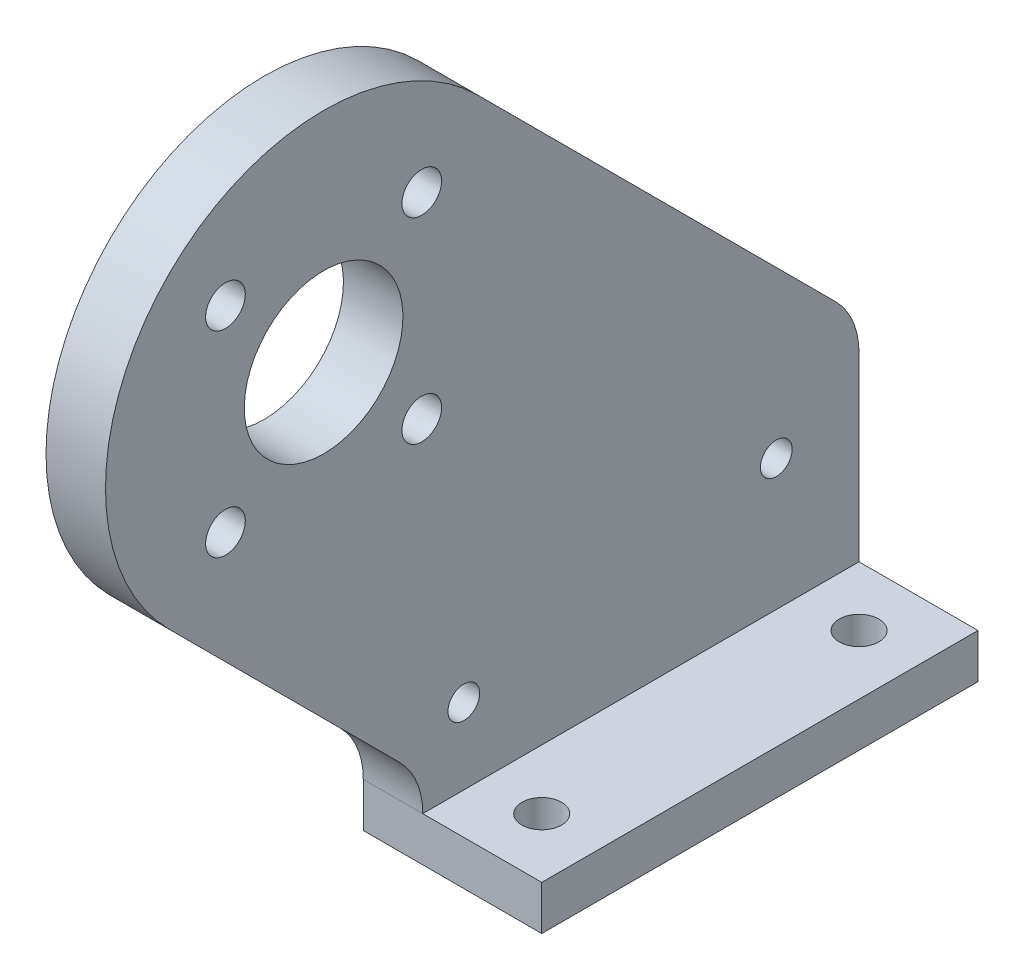
ISO-10303-21;
HEADER;
FILE_DESCRIPTION(('STEP AP214'),'2;1');
FILE_NAME('part.step','',(''),(''),'','','');
FILE_SCHEMA(('AUTOMOTIVE_DESIGN { 1 0 10303 214 1 1 1 1 }'));
ENDSEC;
DATA;
#1=APPLICATION_CONTEXT('core data for automotive mechanical design processes');
#2=APPLICATION_PROTOCOL_DEFINITION('international standard','automotive_design',2000,#1);
#3=PRODUCT_CONTEXT('',#1,'mechanical');
#4=PRODUCT('Part','Part','',(#3));
#5=PRODUCT_RELATED_PRODUCT_CATEGORY('part','',(#4));
#6=PRODUCT_DEFINITION_FORMATION('','',#4);
#7=PRODUCT_DEFINITION_CONTEXT('part definition',#1,'design');
#8=PRODUCT_DEFINITION('design','',#6,#7);
#9=PRODUCT_DEFINITION_SHAPE('','',#8);
#10=(LENGTH_UNIT() NAMED_UNIT(*) SI_UNIT(.MILLI.,.METRE.));
#11=(NAMED_UNIT(*) PLANE_ANGLE_UNIT() SI_UNIT($,.RADIAN.));
#12=(NAMED_UNIT(*) SI_UNIT($,.STERADIAN.) SOLID_ANGLE_UNIT());
#13=UNCERTAINTY_MEASURE_WITH_UNIT(LENGTH_MEASURE(1.E-05),#10,'distance_accuracy_value','');
#14=(GEOMETRIC_REPRESENTATION_CONTEXT(3) GLOBAL_UNCERTAINTY_ASSIGNED_CONTEXT((#13)) GLOBAL_UNIT_ASSIGNED_CONTEXT((#10,
#11,#12)) REPRESENTATION_CONTEXT('',''));
#15=CARTESIAN_POINT('',(0.,0.,0.));
#16=DIRECTION('',(0.,0.,1.));
#17=DIRECTION('',(1.,0.,0.));
#18=AXIS2_PLACEMENT_3D('',#15,#16,#17);
#19=CARTESIAN_POINT('',(58.5,-18.900505063,-2.));
#20=DIRECTION('',(1.,0.,0.));
#21=DIRECTION('',(0.,1.,0.));
#22=AXIS2_PLACEMENT_3D('',#19,#20,#21);
#23=CYLINDRICAL_SURFACE('',#22,4.);
#24=CARTESIAN_POINT('',(58.5,-18.900505063,-2.));
#25=DIRECTION('',(1.,0.,0.));
#26=DIRECTION('',(0.,1.,0.));
#27=AXIS2_PLACEMENT_3D('',#24,#25,#26);
#28=CIRCLE('',#27,4.);
#29=CARTESIAN_POINT('',(58.5,-18.900505063,-6.));
#30=VERTEX_POINT('',#29);
#31=CARTESIAN_POINT('',(58.5,-16.07207793875,-4.82842712475));
#32=VERTEX_POINT('',#31);
#33=EDGE_CURVE('E21',#30,#32,#28,.T.);
#34=ORIENTED_EDGE('',*,*,#33,.T.);
#35=DIRECTION('',(1.,0.,0.));
#36=VECTOR('',#35,1.);
#37=CARTESIAN_POINT('',(60.,-16.072077939,-4.828427125));
#38=LINE('',#37,#36);
#39=CARTESIAN_POINT('',(61.5,-16.0720779371654,-4.82842712599426));
#40=VERTEX_POINT('',#39);
#41=EDGE_CURVE('E110',#32,#40,#38,.T.);
#42=ORIENTED_EDGE('',*,*,#41,.T.);
#43=CARTESIAN_POINT('',(61.5,-18.900505063,-2.));
#44=DIRECTION('',(1.,0.,0.));
#45=DIRECTION('',(0.,1.,0.));
#46=AXIS2_PLACEMENT_3D('',#43,#44,#45);
#47=CIRCLE('',#46,4.);
#48=CARTESIAN_POINT('',(61.5,-18.900505063,-6.));
#49=VERTEX_POINT('',#48);
#50=EDGE_CURVE('E102',#49,#40,#47,.T.);
#51=ORIENTED_EDGE('',*,*,#50,.F.);
#52=DIRECTION('',(1.,0.,0.));
#53=VECTOR('',#52,1.);
#54=CARTESIAN_POINT('',(63.,-18.900505063,-6.));
#55=LINE('',#54,#53);
#56=EDGE_CURVE('E94',#30,#49,#55,.T.);
#57=ORIENTED_EDGE('',*,*,#56,.F.);
#58=EDGE_LOOP('',(#34,#42,#51,#57));
#59=FACE_BOUND('',#58,.T.);
#60=ADVANCED_FACE('F17',(#59),#23,.T.);
#61=CARTESIAN_POINT('',(61.5,-16.072077939,-4.828427125));
#62=DIRECTION('',(0.,-0.707106781186547,0.707106781186547));
#63=DIRECTION('',(0.,0.707106781186547,0.707106781186547));
#64=AXIS2_PLACEMENT_3D('',#61,#62,#63);
#65=PLANE('',#64);
#66=DIRECTION('',(0.,0.707106781186547,0.707106781186547));
#67=VECTOR('',#66,1.);
#68=CARTESIAN_POINT('',(58.5,-16.072077939,-4.828427125));
#69=LINE('',#68,#67);
#70=CARTESIAN_POINT('',(58.5,1.97817459217873,13.2218254061267));
#71=VERTEX_POINT('',#70);
#72=EDGE_CURVE('E85',#32,#71,#69,.T.);
#73=ORIENTED_EDGE('',*,*,#72,.T.);
#74=DIRECTION('',(-1.,0.,0.));
#75=VECTOR('',#74,1.);
#76=CARTESIAN_POINT('',(60.,1.97817459135746,13.2218254052534));
#77=LINE('',#76,#75);
#78=CARTESIAN_POINT('',(61.5,1.97817459297517,13.2218254062661));
#79=VERTEX_POINT('',#78);
#80=EDGE_CURVE('E211',#71,#79,#77,.F.);
#81=ORIENTED_EDGE('',*,*,#80,.T.);
#82=DIRECTION('',(0.,0.707106781101469,0.707106781271627));
#83=VECTOR('',#82,1.);
#84=CARTESIAN_POINT('',(61.5,-16.0720779422184,-4.828427133876));
#85=LINE('',#84,#83);
#86=EDGE_CURVE('E174',#40,#79,#85,.T.);
#87=ORIENTED_EDGE('',*,*,#86,.F.);
#88=ORIENTED_EDGE('',*,*,#41,.F.);
#89=EDGE_LOOP('',(#73,#81,#87,#88));
#90=FACE_BOUND('',#89,.T.);
#91=ADVANCED_FACE('F209',(#90),#65,.F.);
#92=CARTESIAN_POINT('',(61.5,-5.8,21.));
#93=DIRECTION('',(-1.,0.,0.));
#94=DIRECTION('',(0.,-1.,0.));
#95=AXIS2_PLACEMENT_3D('',#92,#93,#94);
#96=CYLINDRICAL_SURFACE('',#95,11.);
#97=ORIENTED_EDGE('',*,*,#80,.F.);
#98=CARTESIAN_POINT('',(58.5,-5.8,21.));
#99=DIRECTION('',(-1.,0.,0.));
#100=DIRECTION('',(0.,-1.,0.));
#101=AXIS2_PLACEMENT_3D('',#98,#99,#100);
#102=CIRCLE('',#101,11.);
#103=CARTESIAN_POINT('',(58.5,-13.578174593,28.778174593));
#104=VERTEX_POINT('',#103);
#105=EDGE_CURVE('E204',#71,#104,#102,.F.);
#106=ORIENTED_EDGE('',*,*,#105,.T.);
#107=DIRECTION('',(1.,0.,0.));
#108=VECTOR('',#107,1.);
#109=CARTESIAN_POINT('',(60.,-13.578174593,28.778174593));
#110=LINE('',#109,#108);
#111=CARTESIAN_POINT('',(61.5,-13.5781745846093,28.778174587786));
#112=VERTEX_POINT('',#111);
#113=EDGE_CURVE('E213',#104,#112,#110,.T.);
#114=ORIENTED_EDGE('',*,*,#113,.T.);
#115=CARTESIAN_POINT('',(61.5,-5.8,21.));
#116=DIRECTION('',(-1.,0.,0.));
#117=DIRECTION('',(0.,-1.,0.));
#118=AXIS2_PLACEMENT_3D('',#115,#116,#117);
#119=CIRCLE('',#118,11.);
#120=EDGE_CURVE('E172',#79,#112,#119,.F.);
#121=ORIENTED_EDGE('',*,*,#120,.F.);
#122=EDGE_LOOP('',(#97,#106,#114,#121));
#123=FACE_BOUND('',#122,.T.);
#124=ADVANCED_FACE('F267',(#123),#96,.T.);
#125=CARTESIAN_POINT('',(61.5,-13.578174593,28.778174593));
#126=DIRECTION('',(0.,0.707106781186548,-0.707106781186547));
#127=DIRECTION('',(0.,-0.707106781186547,-0.707106781186548));
#128=AXIS2_PLACEMENT_3D('',#125,#126,#127);
#129=PLANE('',#128);
#130=DIRECTION('',(0.,-0.707106781186547,-0.707106781186548));
#131=VECTOR('',#130,1.);
#132=CARTESIAN_POINT('',(58.5,-13.578174593,28.778174593));
#133=LINE('',#132,#131);
#134=CARTESIAN_POINT('',(58.5,-25.1847763120801,17.1715728744199));
#135=VERTEX_POINT('',#134);
#136=EDGE_CURVE('E201',#104,#135,#133,.T.);
#137=ORIENTED_EDGE('',*,*,#136,.T.);
#138=DIRECTION('',(1.,0.,0.));
#139=VECTOR('',#138,1.);
#140=CARTESIAN_POINT('',(60.,-25.1847763131602,17.1715728738398));
#141=LINE('',#140,#139);
#142=CARTESIAN_POINT('',(61.5,-25.1847763082255,17.1715728694101));
#143=VERTEX_POINT('',#142);
#144=EDGE_CURVE('E89',#143,#135,#141,.F.);
#145=ORIENTED_EDGE('',*,*,#144,.F.);
#146=DIRECTION('',(0.,-0.707106781475344,-0.707106780897751));
#147=VECTOR('',#146,1.);
#148=CARTESIAN_POINT('',(61.5,-13.5781745803226,28.778174578468));
#149=LINE('',#148,#147);
#150=EDGE_CURVE('E170',#112,#143,#149,.T.);
#151=ORIENTED_EDGE('',*,*,#150,.F.);
#152=ORIENTED_EDGE('',*,*,#113,.F.);
#153=EDGE_LOOP('',(#137,#145,#151,#152));
#154=FACE_BOUND('',#153,.T.);
#155=ADVANCED_FACE('F264',(#154),#129,.F.);
#156=CARTESIAN_POINT('',(61.5,-28.013203436,20.));
#157=DIRECTION('',(-1.,0.,0.));
#158=DIRECTION('',(0.,-1.,0.));
#159=AXIS2_PLACEMENT_3D('',#156,#157,#158);
#160=CYLINDRICAL_SURFACE('',#159,3.99999999965183);
#161=DIRECTION('',(-1.,0.,0.));
#162=VECTOR('',#161,1.);
#163=CARTESIAN_POINT('',(63.,-28.013203436,16.));
#164=LINE('',#163,#162);
#165=CARTESIAN_POINT('',(61.4999999985,-28.013203436,16.0000000001741));
#166=VERTEX_POINT('',#165);
#167=CARTESIAN_POINT('',(58.5,-28.013203436,16.));
#168=VERTEX_POINT('',#167);
#169=EDGE_CURVE('E106',#166,#168,#164,.T.);
#170=ORIENTED_EDGE('',*,*,#169,.F.);
#171=CARTESIAN_POINT('',(61.5,-28.013203436,20.));
#172=DIRECTION('',(-1.,0.,0.));
#173=DIRECTION('',(0.,-1.,0.));
#174=AXIS2_PLACEMENT_3D('',#171,#172,#173);
#175=CIRCLE('',#174,3.99999999965183);
#176=EDGE_CURVE('E36',#143,#166,#175,.T.);
#177=ORIENTED_EDGE('',*,*,#176,.F.);
#178=ORIENTED_EDGE('',*,*,#144,.T.);
#179=CARTESIAN_POINT('',(58.5,-28.013203436,20.));
#180=DIRECTION('',(-1.,0.,0.));
#181=DIRECTION('',(0.,-1.,0.));
#182=AXIS2_PLACEMENT_3D('',#179,#180,#181);
#183=CIRCLE('',#182,3.99999999965183);
#184=EDGE_CURVE('E198',#135,#168,#183,.T.);
#185=ORIENTED_EDGE('',*,*,#184,.T.);
#186=EDGE_LOOP('',(#170,#177,#178,#185));
#187=FACE_BOUND('',#186,.T.);
#188=ADVANCED_FACE('F275',(#187),#160,.F.);
#189=CARTESIAN_POINT('',(61.5,-10.749747468,25.949747468));
#190=DIRECTION('',(-1.,0.,0.));
#191=DIRECTION('',(0.,-1.,0.));
#192=AXIS2_PLACEMENT_3D('',#189,#190,#191);
#193=CYLINDRICAL_SURFACE('',#192,1.);
#194=CARTESIAN_POINT('',(61.5,-10.749747468,25.949747468));
#195=DIRECTION('',(-1.,0.,0.));
#196=DIRECTION('',(0.,-1.,0.));
#197=AXIS2_PLACEMENT_3D('',#194,#195,#196);
#198=CIRCLE('',#197,1.);
#199=CARTESIAN_POINT('',(61.5,-11.749747468,25.949747468));
#200=VERTEX_POINT('',#199);
#201=EDGE_CURVE('E166',#200,#200,#198,.T.);
#202=ORIENTED_EDGE('',*,*,#201,.F.);
#203=EDGE_LOOP('',(#202));
#204=FACE_BOUND('',#203,.T.);
#205=CARTESIAN_POINT('',(58.5,-10.749747468,25.949747468));
#206=DIRECTION('',(-1.,0.,0.));
#207=DIRECTION('',(0.,-1.,0.));
#208=AXIS2_PLACEMENT_3D('',#205,#206,#207);
#209=CIRCLE('',#208,1.);
#210=CARTESIAN_POINT('',(58.5,-11.749747468,25.949747468));
#211=VERTEX_POINT('',#210);
#212=EDGE_CURVE('E195',#211,#211,#209,.T.);
#213=ORIENTED_EDGE('',*,*,#212,.T.);
#214=EDGE_LOOP('',(#213));
#215=FACE_BOUND('',#214,.T.);
#216=ADVANCED_FACE('F317',(#204,#215),#193,.F.);
#217=CARTESIAN_POINT('',(61.5,-10.749747468,16.050252532));
#218=DIRECTION('',(-1.,0.,0.));
#219=DIRECTION('',(0.,-1.,0.));
#220=AXIS2_PLACEMENT_3D('',#217,#218,#219);
#221=CYLINDRICAL_SURFACE('',#220,1.);
#222=CARTESIAN_POINT('',(61.5,-10.749747468,16.050252532));
#223=DIRECTION('',(-1.,0.,0.));
#224=DIRECTION('',(0.,-1.,0.));
#225=AXIS2_PLACEMENT_3D('',#222,#223,#224);
#226=CIRCLE('',#225,1.);
#227=CARTESIAN_POINT('',(61.5,-11.749747468,16.050252532));
#228=VERTEX_POINT('',#227);
#229=EDGE_CURVE('E163',#228,#228,#226,.T.);
#230=ORIENTED_EDGE('',*,*,#229,.F.);
#231=EDGE_LOOP('',(#230));
#232=FACE_BOUND('',#231,.T.);
#233=CARTESIAN_POINT('',(58.5,-10.749747468,16.050252532));
#234=DIRECTION('',(-1.,0.,0.));
#235=DIRECTION('',(0.,-1.,0.));
#236=AXIS2_PLACEMENT_3D('',#233,#234,#235);
#237=CIRCLE('',#236,1.);
#238=CARTESIAN_POINT('',(58.5,-11.749747468,16.050252532));
#239=VERTEX_POINT('',#238);
#240=EDGE_CURVE('E99',#239,#239,#237,.T.);
#241=ORIENTED_EDGE('',*,*,#240,.T.);
#242=EDGE_LOOP('',(#241));
#243=FACE_BOUND('',#242,.T.);
#244=ADVANCED_FACE('F313',(#232,#243),#221,.F.);
#245=CARTESIAN_POINT('',(61.5,-0.850252532,16.050252532));
#246=DIRECTION('',(-1.,0.,0.));
#247=DIRECTION('',(0.,-1.,0.));
#248=AXIS2_PLACEMENT_3D('',#245,#246,#247);
#249=CYLINDRICAL_SURFACE('',#248,1.);
#250=CARTESIAN_POINT('',(61.5,-0.850252532,16.050252532));
#251=DIRECTION('',(-1.,0.,0.));
#252=DIRECTION('',(0.,-1.,0.));
#253=AXIS2_PLACEMENT_3D('',#250,#251,#252);
#254=CIRCLE('',#253,1.);
#255=CARTESIAN_POINT('',(61.5,-1.850252532,16.050252532));
#256=VERTEX_POINT('',#255);
#257=EDGE_CURVE('E160',#256,#256,#254,.T.);
#258=ORIENTED_EDGE('',*,*,#257,.F.);
#259=EDGE_LOOP('',(#258));
#260=FACE_BOUND('',#259,.T.);
#261=CARTESIAN_POINT('',(58.5,-0.85025253200001,16.050252532));
#262=DIRECTION('',(-1.,0.,0.));
#263=DIRECTION('',(0.,-1.,0.));
#264=AXIS2_PLACEMENT_3D('',#261,#262,#263);
#265=CIRCLE('',#264,1.);
#266=CARTESIAN_POINT('',(58.5,-1.85025253200001,16.050252532));
#267=VERTEX_POINT('',#266);
#268=EDGE_CURVE('E192',#267,#267,#265,.T.);
#269=ORIENTED_EDGE('',*,*,#268,.T.);
#270=EDGE_LOOP('',(#269));
#271=FACE_BOUND('',#270,.T.);
#272=ADVANCED_FACE('F309',(#260,#271),#249,.F.);
#273=CARTESIAN_POINT('',(61.5,-0.850252532,25.949747468));
#274=DIRECTION('',(-1.,0.,0.));
#275=DIRECTION('',(0.,-1.,0.));
#276=AXIS2_PLACEMENT_3D('',#273,#274,#275);
#277=CYLINDRICAL_SURFACE('',#276,1.);
#278=CARTESIAN_POINT('',(61.5,-0.850252532,25.949747468));
#279=DIRECTION('',(-1.,0.,0.));
#280=DIRECTION('',(0.,-1.,0.));
#281=AXIS2_PLACEMENT_3D('',#278,#279,#280);
#282=CIRCLE('',#281,1.);
#283=CARTESIAN_POINT('',(61.5,-1.850252532,25.949747468));
#284=VERTEX_POINT('',#283);
#285=EDGE_CURVE('E157',#284,#284,#282,.T.);
#286=ORIENTED_EDGE('',*,*,#285,.F.);
#287=EDGE_LOOP('',(#286));
#288=FACE_BOUND('',#287,.T.);
#289=CARTESIAN_POINT('',(58.5,-0.85025253200001,25.949747468));
#290=DIRECTION('',(-1.,0.,0.));
#291=DIRECTION('',(0.,-1.,0.));
#292=AXIS2_PLACEMENT_3D('',#289,#290,#291);
#293=CIRCLE('',#292,1.);
#294=CARTESIAN_POINT('',(58.5,-1.85025253200001,25.949747468));
#295=VERTEX_POINT('',#294);
#296=EDGE_CURVE('E180',#295,#295,#293,.T.);
#297=ORIENTED_EDGE('',*,*,#296,.T.);
#298=EDGE_LOOP('',(#297));
#299=FACE_BOUND('',#298,.T.);
#300=ADVANCED_FACE('F305',(#288,#299),#277,.F.);
#301=CARTESIAN_POINT('',(61.5,-24.184776311,13.928932188));
#302=DIRECTION('',(-1.,0.,0.));
#303=DIRECTION('',(0.,0.,1.));
#304=AXIS2_PLACEMENT_3D('',#301,#302,#303);
#305=CYLINDRICAL_SURFACE('',#304,0.799999999999995);
#306=CARTESIAN_POINT('',(58.5,-24.184776311,13.928932188));
#307=DIRECTION('',(-1.,0.,0.));
#308=DIRECTION('',(0.,0.,1.));
#309=AXIS2_PLACEMENT_3D('',#306,#307,#308);
#310=CIRCLE('',#309,0.799999999999995);
#311=CARTESIAN_POINT('',(58.5,-24.184776311,14.728932188));
#312=VERTEX_POINT('',#311);
#313=EDGE_CURVE('E189',#312,#312,#310,.T.);
#314=ORIENTED_EDGE('',*,*,#313,.T.);
#315=EDGE_LOOP('',(#314));
#316=FACE_BOUND('',#315,.T.);
#317=CARTESIAN_POINT('',(61.5,-24.184776311,13.928932188));
#318=DIRECTION('',(-1.,0.,0.));
#319=DIRECTION('',(0.,0.,1.));
#320=AXIS2_PLACEMENT_3D('',#317,#318,#319);
#321=CIRCLE('',#320,0.799999999999995);
#322=CARTESIAN_POINT('',(61.5,-24.184776311,14.728932188));
#323=VERTEX_POINT('',#322);
#324=EDGE_CURVE('E154',#323,#323,#321,.T.);
#325=ORIENTED_EDGE('',*,*,#324,.F.);
#326=EDGE_LOOP('',(#325));
#327=FACE_BOUND('',#326,.T.);
#328=ADVANCED_FACE('F301',(#316,#327),#305,.F.);
#329=CARTESIAN_POINT('',(61.5,-21.406405468,-1.82799186));
#330=DIRECTION('',(-1.,0.,0.));
#331=DIRECTION('',(0.,0.,1.));
#332=AXIS2_PLACEMENT_3D('',#329,#330,#331);
#333=CYLINDRICAL_SURFACE('',#332,0.800000000000002);
#334=CARTESIAN_POINT('',(58.5,-21.406405468,-1.82799186000001));
#335=DIRECTION('',(-1.,0.,0.));
#336=DIRECTION('',(0.,0.,1.));
#337=AXIS2_PLACEMENT_3D('',#334,#335,#336);
#338=CIRCLE('',#337,0.800000000000002);
#339=CARTESIAN_POINT('',(58.5,-21.406405468,-1.02799186000001));
#340=VERTEX_POINT('',#339);
#341=EDGE_CURVE('E183',#340,#340,#338,.T.);
#342=ORIENTED_EDGE('',*,*,#341,.T.);
#343=EDGE_LOOP('',(#342));
#344=FACE_BOUND('',#343,.T.);
#345=CARTESIAN_POINT('',(61.5,-21.406405468,-1.82799186));
#346=DIRECTION('',(-1.,0.,0.));
#347=DIRECTION('',(0.,0.,1.));
#348=AXIS2_PLACEMENT_3D('',#345,#346,#347);
#349=CIRCLE('',#348,0.800000000000002);
#350=CARTESIAN_POINT('',(61.5,-21.406405468,-1.02799186));
#351=VERTEX_POINT('',#350);
#352=EDGE_CURVE('E151',#351,#351,#349,.T.);
#353=ORIENTED_EDGE('',*,*,#352,.F.);
#354=EDGE_LOOP('',(#353));
#355=FACE_BOUND('',#354,.T.);
#356=ADVANCED_FACE('F297',(#344,#355),#333,.F.);
#357=CARTESIAN_POINT('',(61.5,-5.8,21.));
#358=DIRECTION('',(-1.,0.,0.));
#359=DIRECTION('',(0.,-1.,0.));
#360=AXIS2_PLACEMENT_3D('',#357,#358,#359);
#361=CYLINDRICAL_SURFACE('',#360,4.);
#362=CARTESIAN_POINT('',(58.5,-5.8,21.));
#363=DIRECTION('',(-1.,0.,0.));
#364=DIRECTION('',(0.,-1.,0.));
#365=AXIS2_PLACEMENT_3D('',#362,#363,#364);
#366=CIRCLE('',#365,4.);
#367=CARTESIAN_POINT('',(58.5,-9.8,21.));
#368=VERTEX_POINT('',#367);
#369=EDGE_CURVE('E186',#368,#368,#366,.T.);
#370=ORIENTED_EDGE('',*,*,#369,.T.);
#371=EDGE_LOOP('',(#370));
#372=FACE_BOUND('',#371,.T.);
#373=CARTESIAN_POINT('',(61.5,-5.8,21.));
#374=DIRECTION('',(-1.,0.,0.));
#375=DIRECTION('',(0.,-1.,0.));
#376=AXIS2_PLACEMENT_3D('',#373,#374,#375);
#377=CIRCLE('',#376,4.);
#378=CARTESIAN_POINT('',(61.5,-9.8,21.));
#379=VERTEX_POINT('',#378);
#380=EDGE_CURVE('E122',#379,#379,#377,.T.);
#381=ORIENTED_EDGE('',*,*,#380,.F.);
#382=EDGE_LOOP('',(#381));
#383=FACE_BOUND('',#382,.T.);
#384=ADVANCED_FACE('F294',(#372,#383),#361,.F.);
#385=CARTESIAN_POINT('',(58.5,-30.249489743,32.228));
#386=DIRECTION('',(1.,0.,0.));
#387=DIRECTION('',(0.,0.,-1.));
#388=AXIS2_PLACEMENT_3D('',#385,#386,#387);
#389=PLANE('',#388);
#390=ORIENTED_EDGE('',*,*,#240,.F.);
#391=EDGE_LOOP('',(#390));
#392=FACE_BOUND('',#391,.T.);
#393=ORIENTED_EDGE('',*,*,#296,.F.);
#394=EDGE_LOOP('',(#393));
#395=FACE_BOUND('',#394,.T.);
#396=ORIENTED_EDGE('',*,*,#341,.F.);
#397=EDGE_LOOP('',(#396));
#398=FACE_BOUND('',#397,.T.);
#399=ORIENTED_EDGE('',*,*,#369,.F.);
#400=EDGE_LOOP('',(#399));
#401=FACE_BOUND('',#400,.T.);
#402=ORIENTED_EDGE('',*,*,#313,.F.);
#403=EDGE_LOOP('',(#402));
#404=FACE_BOUND('',#403,.T.);
#405=ORIENTED_EDGE('',*,*,#268,.F.);
#406=EDGE_LOOP('',(#405));
#407=FACE_BOUND('',#406,.T.);
#408=ORIENTED_EDGE('',*,*,#212,.F.);
#409=EDGE_LOOP('',(#408));
#410=FACE_BOUND('',#409,.T.);
#411=ORIENTED_EDGE('',*,*,#136,.F.);
#412=ORIENTED_EDGE('',*,*,#105,.F.);
#413=ORIENTED_EDGE('',*,*,#72,.F.);
#414=ORIENTED_EDGE('',*,*,#33,.F.);
#415=DIRECTION('',(0.,1.,0.));
#416=VECTOR('',#415,1.);
#417=CARTESIAN_POINT('',(58.5,-24.574997403,-6.));
#418=LINE('',#417,#416);
#419=CARTESIAN_POINT('',(58.5,-30.249489743,-6.));
#420=VERTEX_POINT('',#419);
#421=EDGE_CURVE('E81',#420,#30,#418,.T.);
#422=ORIENTED_EDGE('',*,*,#421,.F.);
#423=DIRECTION('',(0.,0.,-1.));
#424=VECTOR('',#423,1.);
#425=CARTESIAN_POINT('',(58.5,-30.249489743,5.));
#426=LINE('',#425,#424);
#427=CARTESIAN_POINT('',(58.5,-30.249489743,16.));
#428=VERTEX_POINT('',#427);
#429=EDGE_CURVE('E121',#428,#420,#426,.T.);
#430=ORIENTED_EDGE('',*,*,#429,.F.);
#431=DIRECTION('',(0.,-1.,0.));
#432=VECTOR('',#431,1.);
#433=CARTESIAN_POINT('',(58.5,-29.1313465895,16.));
#434=LINE('',#433,#432);
#435=EDGE_CURVE('E125',#168,#428,#434,.T.);
#436=ORIENTED_EDGE('',*,*,#435,.F.);
#437=ORIENTED_EDGE('',*,*,#184,.F.);
#438=EDGE_LOOP('',(#411,#412,#413,#414,#422,#430,#436,#437));
#439=FACE_BOUND('',#438,.T.);
#440=ADVANCED_FACE('F79',(#392,#395,#398,#401,#404,#407,#410,#439),#389,.F.);
#441=CARTESIAN_POINT('',(58.5,-18.900505063,-6.));
#442=DIRECTION('',(0.,0.,-1.));
#443=DIRECTION('',(1.,0.,0.));
#444=AXIS2_PLACEMENT_3D('',#441,#442,#443);
#445=PLANE('',#444);
#446=DIRECTION('',(1.,0.,0.));
#447=VECTOR('',#446,1.);
#448=CARTESIAN_POINT('',(64.5,-28.013203436,-6.));
#449=LINE('',#448,#447);
#450=CARTESIAN_POINT('',(61.5,-28.013203436,-6.));
#451=VERTEX_POINT('',#450);
#452=CARTESIAN_POINT('',(67.5,-28.013203436,-6.));
#453=VERTEX_POINT('',#452);
#454=EDGE_CURVE('E148',#451,#453,#449,.T.);
#455=ORIENTED_EDGE('',*,*,#454,.T.);
#456=DIRECTION('',(0.,1.,0.));
#457=VECTOR('',#456,1.);
#458=CARTESIAN_POINT('',(67.5,-29.1313465895,-6.));
#459=LINE('',#458,#457);
#460=CARTESIAN_POINT('',(67.5,-30.249489743,-6.));
#461=VERTEX_POINT('',#460);
#462=EDGE_CURVE('E103',#461,#453,#459,.T.);
#463=ORIENTED_EDGE('',*,*,#462,.F.);
#464=DIRECTION('',(1.,0.,0.));
#465=VECTOR('',#464,1.);
#466=CARTESIAN_POINT('',(63.,-30.249489743,-6.));
#467=LINE('',#466,#465);
#468=EDGE_CURVE('E98',#420,#461,#467,.T.);
#469=ORIENTED_EDGE('',*,*,#468,.F.);
#470=ORIENTED_EDGE('',*,*,#421,.T.);
#471=ORIENTED_EDGE('',*,*,#56,.T.);
#472=DIRECTION('',(0.,1.,0.));
#473=VECTOR('',#472,1.);
#474=CARTESIAN_POINT('',(61.5,-11.3069621075,-6.));
#475=LINE('',#474,#473);
#476=EDGE_CURVE('E177',#451,#49,#475,.T.);
#477=ORIENTED_EDGE('',*,*,#476,.F.);
#478=EDGE_LOOP('',(#455,#463,#469,#470,#471,#477));
#479=FACE_BOUND('',#478,.T.);
#480=ADVANCED_FACE('F92',(#479),#445,.T.);
#481=CARTESIAN_POINT('',(67.5,-30.249489743,16.));
#482=DIRECTION('',(1.,0.,0.));
#483=DIRECTION('',(0.,0.,-1.));
#484=AXIS2_PLACEMENT_3D('',#481,#482,#483);
#485=PLANE('',#484);
#486=ORIENTED_EDGE('',*,*,#462,.T.);
#487=DIRECTION('',(0.,0.,1.));
#488=VECTOR('',#487,1.);
#489=CARTESIAN_POINT('',(67.5,-28.013203436,5.));
#490=LINE('',#489,#488);
#491=CARTESIAN_POINT('',(67.5,-28.013203436,16.));
#492=VERTEX_POINT('',#491);
#493=EDGE_CURVE('E222',#453,#492,#490,.T.);
#494=ORIENTED_EDGE('',*,*,#493,.T.);
#495=DIRECTION('',(0.,1.,0.));
#496=VECTOR('',#495,1.);
#497=CARTESIAN_POINT('',(67.5,-29.1313465895,16.));
#498=LINE('',#497,#496);
#499=CARTESIAN_POINT('',(67.5,-30.249489743,16.));
#500=VERTEX_POINT('',#499);
#501=EDGE_CURVE('E128',#500,#492,#498,.T.);
#502=ORIENTED_EDGE('',*,*,#501,.F.);
#503=DIRECTION('',(0.,0.,1.));
#504=VECTOR('',#503,1.);
#505=CARTESIAN_POINT('',(67.5,-30.249489743,5.));
#506=LINE('',#505,#504);
#507=EDGE_CURVE('E112',#461,#500,#506,.T.);
#508=ORIENTED_EDGE('',*,*,#507,.F.);
#509=EDGE_LOOP('',(#486,#494,#502,#508));
#510=FACE_BOUND('',#509,.T.);
#511=ADVANCED_FACE('F328',(#510),#485,.T.);
#512=CARTESIAN_POINT('',(67.5,-30.249489743,16.));
#513=DIRECTION('',(0.,0.,1.));
#514=DIRECTION('',(0.,1.,0.));
#515=AXIS2_PLACEMENT_3D('',#512,#513,#514);
#516=PLANE('',#515);
#517=DIRECTION('',(-1.,0.,0.));
#518=VECTOR('',#517,1.);
#519=CARTESIAN_POINT('',(63.,-30.249489743,16.));
#520=LINE('',#519,#518);
#521=EDGE_CURVE('E118',#500,#428,#520,.T.);
#522=ORIENTED_EDGE('',*,*,#521,.F.);
#523=ORIENTED_EDGE('',*,*,#501,.T.);
#524=DIRECTION('',(-1.,0.,0.));
#525=VECTOR('',#524,1.);
#526=CARTESIAN_POINT('',(64.5,-28.013203436,16.));
#527=LINE('',#526,#525);
#528=EDGE_CURVE('E225',#492,#166,#527,.T.);
#529=ORIENTED_EDGE('',*,*,#528,.T.);
#530=ORIENTED_EDGE('',*,*,#169,.T.);
#531=ORIENTED_EDGE('',*,*,#435,.T.);
#532=EDGE_LOOP('',(#522,#523,#529,#530,#531));
#533=FACE_BOUND('',#532,.T.);
#534=ADVANCED_FACE('F325',(#533),#516,.T.);
#535=CARTESIAN_POINT('',(61.5,5.399279221,32.228));
#536=DIRECTION('',(1.,0.,0.));
#537=DIRECTION('',(0.,-1.,0.));
#538=AXIS2_PLACEMENT_3D('',#535,#536,#537);
#539=PLANE('',#538);
#540=ORIENTED_EDGE('',*,*,#380,.T.);
#541=EDGE_LOOP('',(#540));
#542=FACE_BOUND('',#541,.T.);
#543=ORIENTED_EDGE('',*,*,#352,.T.);
#544=EDGE_LOOP('',(#543));
#545=FACE_BOUND('',#544,.T.);
#546=ORIENTED_EDGE('',*,*,#324,.T.);
#547=EDGE_LOOP('',(#546));
#548=FACE_BOUND('',#547,.T.);
#549=ORIENTED_EDGE('',*,*,#285,.T.);
#550=EDGE_LOOP('',(#549));
#551=FACE_BOUND('',#550,.T.);
#552=ORIENTED_EDGE('',*,*,#257,.T.);
#553=EDGE_LOOP('',(#552));
#554=FACE_BOUND('',#553,.T.);
#555=ORIENTED_EDGE('',*,*,#229,.T.);
#556=EDGE_LOOP('',(#555));
#557=FACE_BOUND('',#556,.T.);
#558=ORIENTED_EDGE('',*,*,#201,.T.);
#559=EDGE_LOOP('',(#558));
#560=FACE_BOUND('',#559,.T.);
#561=ORIENTED_EDGE('',*,*,#150,.T.);
#562=ORIENTED_EDGE('',*,*,#176,.T.);
#563=DIRECTION('',(0.,0.,-1.));
#564=VECTOR('',#563,1.);
#565=CARTESIAN_POINT('',(61.5,-28.013203436,5.));
#566=LINE('',#565,#564);
#567=EDGE_CURVE('E145',#166,#451,#566,.T.);
#568=ORIENTED_EDGE('',*,*,#567,.T.);
#569=ORIENTED_EDGE('',*,*,#476,.T.);
#570=ORIENTED_EDGE('',*,*,#50,.T.);
#571=ORIENTED_EDGE('',*,*,#86,.T.);
#572=ORIENTED_EDGE('',*,*,#120,.T.);
#573=EDGE_LOOP('',(#561,#562,#568,#569,#570,#571,#572));
#574=FACE_BOUND('',#573,.T.);
#575=ADVANCED_FACE('F242',(#542,#545,#548,#551,#554,#557,#560,#574),#539,.T.);
#576=CARTESIAN_POINT('',(64.5,-30.249489743,13.));
#577=DIRECTION('',(0.,1.,0.));
#578=DIRECTION('',(0.,0.,1.));
#579=AXIS2_PLACEMENT_3D('',#576,#577,#578);
#580=CYLINDRICAL_SURFACE('',#579,0.999999999999999);
#581=CARTESIAN_POINT('',(64.5,-30.249489743,13.));
#582=DIRECTION('',(0.,1.,0.));
#583=DIRECTION('',(0.,0.,1.));
#584=AXIS2_PLACEMENT_3D('',#581,#582,#583);
#585=CIRCLE('',#584,0.999999999999999);
#586=CARTESIAN_POINT('',(64.5,-30.249489743,14.));
#587=VERTEX_POINT('',#586);
#588=EDGE_CURVE('E115',#587,#587,#585,.T.);
#589=ORIENTED_EDGE('',*,*,#588,.F.);
#590=EDGE_LOOP('',(#589));
#591=FACE_BOUND('',#590,.T.);
#592=CARTESIAN_POINT('',(64.5,-28.013203436,13.));
#593=DIRECTION('',(0.,1.,0.));
#594=DIRECTION('',(0.,0.,1.));
#595=AXIS2_PLACEMENT_3D('',#592,#593,#594);
#596=CIRCLE('',#595,0.999999999999999);
#597=CARTESIAN_POINT('',(64.5,-28.013203436,14.));
#598=VERTEX_POINT('',#597);
#599=EDGE_CURVE('E142',#598,#598,#596,.T.);
#600=ORIENTED_EDGE('',*,*,#599,.T.);
#601=EDGE_LOOP('',(#600));
#602=FACE_BOUND('',#601,.T.);
#603=ADVANCED_FACE('F290',(#591,#602),#580,.F.);
#604=CARTESIAN_POINT('',(58.5,-30.249489743,16.));
#605=DIRECTION('',(0.,-1.,0.));
#606=DIRECTION('',(0.,0.,-1.));
#607=AXIS2_PLACEMENT_3D('',#604,#605,#606);
#608=PLANE('',#607);
#609=ORIENTED_EDGE('',*,*,#588,.T.);
#610=EDGE_LOOP('',(#609));
#611=FACE_BOUND('',#610,.T.);
#612=CARTESIAN_POINT('',(64.5,-30.249489743,-3.));
#613=DIRECTION('',(0.,1.,0.));
#614=DIRECTION('',(0.,0.,1.));
#615=AXIS2_PLACEMENT_3D('',#612,#613,#614);
#616=CIRCLE('',#615,1.);
#617=CARTESIAN_POINT('',(64.5,-30.249489743,-2.));
#618=VERTEX_POINT('',#617);
#619=EDGE_CURVE('E27',#618,#618,#616,.F.);
#620=ORIENTED_EDGE('',*,*,#619,.F.);
#621=EDGE_LOOP('',(#620));
#622=FACE_BOUND('',#621,.T.);
#623=ORIENTED_EDGE('',*,*,#468,.T.);
#624=ORIENTED_EDGE('',*,*,#507,.T.);
#625=ORIENTED_EDGE('',*,*,#521,.T.);
#626=ORIENTED_EDGE('',*,*,#429,.T.);
#627=EDGE_LOOP('',(#623,#624,#625,#626));
#628=FACE_BOUND('',#627,.T.);
#629=ADVANCED_FACE('F259',(#611,#622,#628),#608,.T.);
#630=CARTESIAN_POINT('',(61.5,-28.013203436,16.));
#631=DIRECTION('',(0.,-1.,0.));
#632=DIRECTION('',(0.,0.,-1.));
#633=AXIS2_PLACEMENT_3D('',#630,#631,#632);
#634=PLANE('',#633);
#635=ORIENTED_EDGE('',*,*,#599,.F.);
#636=EDGE_LOOP('',(#635));
#637=FACE_BOUND('',#636,.T.);
#638=CARTESIAN_POINT('',(64.5,-28.013203436,-3.));
#639=DIRECTION('',(0.,1.,0.));
#640=DIRECTION('',(0.,0.,1.));
#641=AXIS2_PLACEMENT_3D('',#638,#639,#640);
#642=CIRCLE('',#641,1.);
#643=CARTESIAN_POINT('',(64.5,-28.013203436,-2.));
#644=VERTEX_POINT('',#643);
#645=EDGE_CURVE('E11',#644,#644,#642,.T.);
#646=ORIENTED_EDGE('',*,*,#645,.F.);
#647=EDGE_LOOP('',(#646));
#648=FACE_BOUND('',#647,.T.);
#649=ORIENTED_EDGE('',*,*,#528,.F.);
#650=ORIENTED_EDGE('',*,*,#493,.F.);
#651=ORIENTED_EDGE('',*,*,#454,.F.);
#652=ORIENTED_EDGE('',*,*,#567,.F.);
#653=EDGE_LOOP('',(#649,#650,#651,#652));
#654=FACE_BOUND('',#653,.T.);
#655=ADVANCED_FACE('F19',(#637,#648,#654),#634,.F.);
#656=CARTESIAN_POINT('',(64.5,-30.249489743,-3.));
#657=DIRECTION('',(0.,1.,0.));
#658=DIRECTION('',(0.,0.,1.));
#659=AXIS2_PLACEMENT_3D('',#656,#657,#658);
#660=CYLINDRICAL_SURFACE('',#659,1.);
#661=ORIENTED_EDGE('',*,*,#645,.T.);
#662=EDGE_LOOP('',(#661));
#663=FACE_BOUND('',#662,.T.);
#664=ORIENTED_EDGE('',*,*,#619,.T.);
#665=EDGE_LOOP('',(#664));
#666=FACE_BOUND('',#665,.T.);
#667=ADVANCED_FACE('F280',(#663,#666),#660,.F.);
#668=CLOSED_SHELL('',(#60,#91,#124,#155,#188,#216,#244,#272,#300,#328,#356,#384,#440,#480,#511,
#534,#575,#603,#629,#655,#667));
#669=MANIFOLD_SOLID_BREP('B1',#668);
#670=ADVANCED_BREP_SHAPE_REPRESENTATION('',(#18,#669),#14);
#671=SHAPE_DEFINITION_REPRESENTATION(#9,#670);
ENDSEC;
END-ISO-10303-21;
